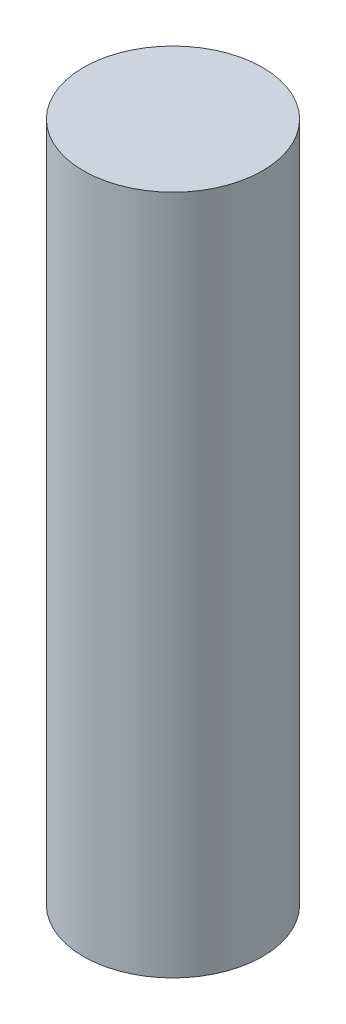
ISO-10303-21;
HEADER;
FILE_DESCRIPTION(('STEP AP214'),'2;1');
FILE_NAME('part.step','',(''),(''),'','','');
FILE_SCHEMA(('AUTOMOTIVE_DESIGN { 1 0 10303 214 1 1 1 1 }'));
ENDSEC;
DATA;
#1=APPLICATION_CONTEXT('core data for automotive mechanical design processes');
#2=APPLICATION_PROTOCOL_DEFINITION('international standard','automotive_design',2000,#1);
#3=PRODUCT_CONTEXT('',#1,'mechanical');
#4=PRODUCT('Part','Part','',(#3));
#5=PRODUCT_RELATED_PRODUCT_CATEGORY('part','',(#4));
#6=PRODUCT_DEFINITION_FORMATION('','',#4);
#7=PRODUCT_DEFINITION_CONTEXT('part definition',#1,'design');
#8=PRODUCT_DEFINITION('design','',#6,#7);
#9=PRODUCT_DEFINITION_SHAPE('','',#8);
#10=(LENGTH_UNIT() NAMED_UNIT(*) SI_UNIT(.MILLI.,.METRE.));
#11=(NAMED_UNIT(*) PLANE_ANGLE_UNIT() SI_UNIT($,.RADIAN.));
#12=(NAMED_UNIT(*) SI_UNIT($,.STERADIAN.) SOLID_ANGLE_UNIT());
#13=UNCERTAINTY_MEASURE_WITH_UNIT(LENGTH_MEASURE(1.E-05),#10,'distance_accuracy_value','');
#14=(GEOMETRIC_REPRESENTATION_CONTEXT(3) GLOBAL_UNCERTAINTY_ASSIGNED_CONTEXT((#13)) GLOBAL_UNIT_ASSIGNED_CONTEXT((#10,
#11,#12)) REPRESENTATION_CONTEXT('',''));
#15=CARTESIAN_POINT('',(0.,0.,0.));
#16=DIRECTION('',(0.,0.,1.));
#17=DIRECTION('',(1.,0.,0.));
#18=AXIS2_PLACEMENT_3D('',#15,#16,#17);
#19=CARTESIAN_POINT('',(0.,11.4,0.));
#20=DIRECTION('',(0.,-1.,0.));
#21=DIRECTION('',(0.,0.,-1.));
#22=AXIS2_PLACEMENT_3D('',#19,#20,#21);
#23=CYLINDRICAL_SURFACE('',#22,1.5);
#24=CARTESIAN_POINT('',(0.,11.4,0.));
#25=DIRECTION('',(0.,1.,0.));
#26=DIRECTION('',(0.,0.,1.));
#27=AXIS2_PLACEMENT_3D('',#24,#25,#26);
#28=CIRCLE('',#27,1.5);
#29=CARTESIAN_POINT('',(0.,11.4,1.5));
#30=VERTEX_POINT('',#29);
#31=EDGE_CURVE('E10',#30,#30,#28,.T.);
#32=ORIENTED_EDGE('',*,*,#31,.F.);
#33=EDGE_LOOP('',(#32));
#34=FACE_BOUND('',#33,.T.);
#35=CARTESIAN_POINT('',(0.,0.,0.));
#36=DIRECTION('',(0.,1.,0.));
#37=DIRECTION('',(0.,0.,1.));
#38=AXIS2_PLACEMENT_3D('',#35,#36,#37);
#39=CIRCLE('',#38,1.5);
#40=CARTESIAN_POINT('',(0.,0.,1.5));
#41=VERTEX_POINT('',#40);
#42=EDGE_CURVE('E42',#41,#41,#39,.T.);
#43=ORIENTED_EDGE('',*,*,#42,.T.);
#44=EDGE_LOOP('',(#43));
#45=FACE_BOUND('',#44,.T.);
#46=ADVANCED_FACE('F39',(#34,#45),#23,.T.);
#47=CARTESIAN_POINT('',(0.,11.4,0.));
#48=DIRECTION('',(0.,1.,0.));
#49=DIRECTION('',(0.,0.,1.));
#50=AXIS2_PLACEMENT_3D('',#47,#48,#49);
#51=PLANE('',#50);
#52=ORIENTED_EDGE('',*,*,#31,.T.);
#53=EDGE_LOOP('',(#52));
#54=FACE_BOUND('',#53,.T.);
#55=ADVANCED_FACE('F54',(#54),#51,.T.);
#56=CARTESIAN_POINT('',(0.,0.,0.));
#57=DIRECTION('',(0.,1.,0.));
#58=DIRECTION('',(0.,0.,1.));
#59=AXIS2_PLACEMENT_3D('',#56,#57,#58);
#60=PLANE('',#59);
#61=ORIENTED_EDGE('',*,*,#42,.F.);
#62=EDGE_LOOP('',(#61));
#63=FACE_BOUND('',#62,.T.);
#64=ADVANCED_FACE('F52',(#63),#60,.F.);
#65=CLOSED_SHELL('',(#46,#55,#64));
#66=MANIFOLD_SOLID_BREP('B2',#65);
#67=ADVANCED_BREP_SHAPE_REPRESENTATION('',(#18,#66),#14);
#68=SHAPE_DEFINITION_REPRESENTATION(#9,#67);
ENDSEC;
END-ISO-10303-21;
